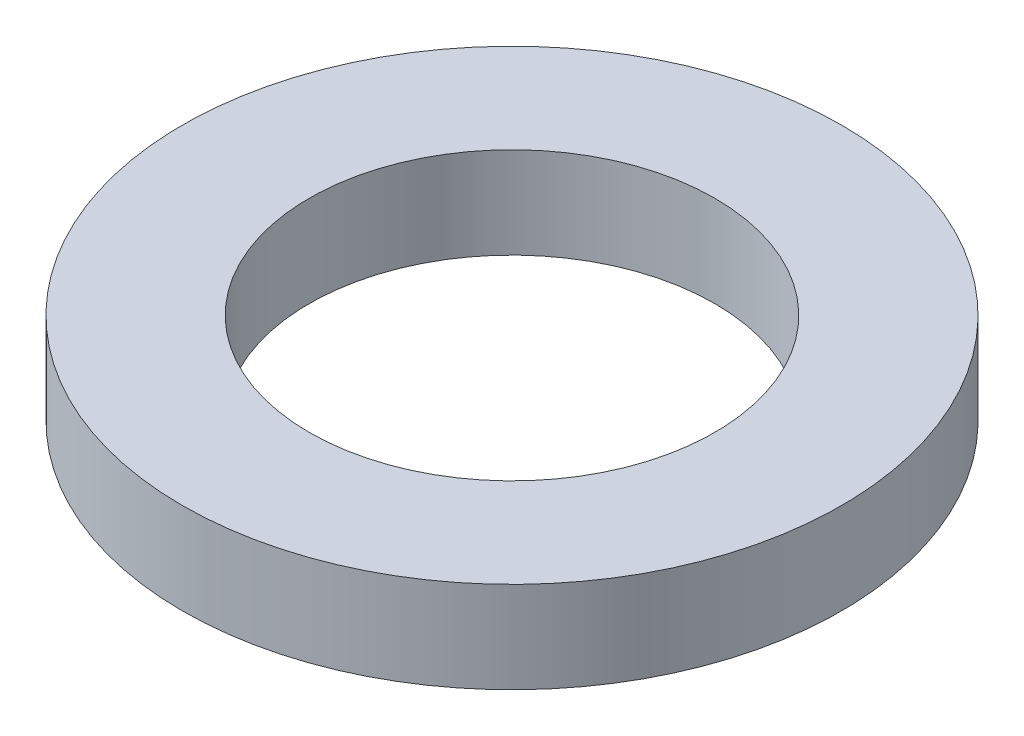
ISO-10303-21;
HEADER;
FILE_DESCRIPTION(('STEP AP214'),'2;1');
FILE_NAME('part.step','',(''),(''),'','','');
FILE_SCHEMA(('AUTOMOTIVE_DESIGN { 1 0 10303 214 1 1 1 1 }'));
ENDSEC;
DATA;
#1=APPLICATION_CONTEXT('core data for automotive mechanical design processes');
#2=APPLICATION_PROTOCOL_DEFINITION('international standard','automotive_design',2000,#1);
#3=PRODUCT_CONTEXT('',#1,'mechanical');
#4=PRODUCT('Part','Part','',(#3));
#5=PRODUCT_RELATED_PRODUCT_CATEGORY('part','',(#4));
#6=PRODUCT_DEFINITION_FORMATION('','',#4);
#7=PRODUCT_DEFINITION_CONTEXT('part definition',#1,'design');
#8=PRODUCT_DEFINITION('design','',#6,#7);
#9=PRODUCT_DEFINITION_SHAPE('','',#8);
#10=(LENGTH_UNIT() NAMED_UNIT(*) SI_UNIT(.MILLI.,.METRE.));
#11=(NAMED_UNIT(*) PLANE_ANGLE_UNIT() SI_UNIT($,.RADIAN.));
#12=(NAMED_UNIT(*) SI_UNIT($,.STERADIAN.) SOLID_ANGLE_UNIT());
#13=UNCERTAINTY_MEASURE_WITH_UNIT(LENGTH_MEASURE(1.E-05),#10,'distance_accuracy_value','');
#14=(GEOMETRIC_REPRESENTATION_CONTEXT(3) GLOBAL_UNCERTAINTY_ASSIGNED_CONTEXT((#13)) GLOBAL_UNIT_ASSIGNED_CONTEXT((#10,
#11,#12)) REPRESENTATION_CONTEXT('',''));
#15=CARTESIAN_POINT('',(0.,0.,0.));
#16=DIRECTION('',(0.,0.,1.));
#17=DIRECTION('',(1.,0.,0.));
#18=AXIS2_PLACEMENT_3D('',#15,#16,#17);
#19=CARTESIAN_POINT('',(0.,18.,0.));
#20=DIRECTION('',(0.,-1.,0.));
#21=DIRECTION('',(0.,0.,-1.));
#22=AXIS2_PLACEMENT_3D('',#19,#20,#21);
#23=CYLINDRICAL_SURFACE('',#22,65.);
#24=CARTESIAN_POINT('',(0.,18.,0.));
#25=DIRECTION('',(0.,1.,0.));
#26=DIRECTION('',(0.,0.,1.));
#27=AXIS2_PLACEMENT_3D('',#24,#25,#26);
#28=CIRCLE('',#27,65.);
#29=CARTESIAN_POINT('',(0.,18.,65.));
#30=VERTEX_POINT('',#29);
#31=EDGE_CURVE('E10',#30,#30,#28,.T.);
#32=ORIENTED_EDGE('',*,*,#31,.F.);
#33=EDGE_LOOP('',(#32));
#34=FACE_BOUND('',#33,.T.);
#35=CARTESIAN_POINT('',(0.,0.,0.));
#36=DIRECTION('',(0.,1.,0.));
#37=DIRECTION('',(0.,0.,1.));
#38=AXIS2_PLACEMENT_3D('',#35,#36,#37);
#39=CIRCLE('',#38,65.);
#40=CARTESIAN_POINT('',(0.,0.,65.));
#41=VERTEX_POINT('',#40);
#42=EDGE_CURVE('E37',#41,#41,#39,.T.);
#43=ORIENTED_EDGE('',*,*,#42,.T.);
#44=EDGE_LOOP('',(#43));
#45=FACE_BOUND('',#44,.T.);
#46=ADVANCED_FACE('F40',(#34,#45),#23,.T.);
#47=CARTESIAN_POINT('',(0.,18.,0.));
#48=DIRECTION('',(0.,1.,0.));
#49=DIRECTION('',(0.,0.,1.));
#50=AXIS2_PLACEMENT_3D('',#47,#48,#49);
#51=PLANE('',#50);
#52=CARTESIAN_POINT('',(0.,18.,0.));
#53=DIRECTION('',(0.,1.,0.));
#54=DIRECTION('',(0.,0.,1.));
#55=AXIS2_PLACEMENT_3D('',#52,#53,#54);
#56=CIRCLE('',#55,40.);
#57=CARTESIAN_POINT('',(0.,18.,40.));
#58=VERTEX_POINT('',#57);
#59=EDGE_CURVE('E50',#58,#58,#56,.T.);
#60=ORIENTED_EDGE('',*,*,#59,.F.);
#61=EDGE_LOOP('',(#60));
#62=FACE_BOUND('',#61,.T.);
#63=ORIENTED_EDGE('',*,*,#31,.T.);
#64=EDGE_LOOP('',(#63));
#65=FACE_BOUND('',#64,.T.);
#66=ADVANCED_FACE('F59',(#62,#65),#51,.T.);
#67=CARTESIAN_POINT('',(0.,0.,0.));
#68=DIRECTION('',(0.,1.,0.));
#69=DIRECTION('',(0.,0.,1.));
#70=AXIS2_PLACEMENT_3D('',#67,#68,#69);
#71=PLANE('',#70);
#72=CARTESIAN_POINT('',(0.,0.,0.));
#73=DIRECTION('',(0.,1.,0.));
#74=DIRECTION('',(0.,0.,1.));
#75=AXIS2_PLACEMENT_3D('',#72,#73,#74);
#76=CIRCLE('',#75,40.);
#77=CARTESIAN_POINT('',(0.,0.,40.));
#78=VERTEX_POINT('',#77);
#79=EDGE_CURVE('E47',#78,#78,#76,.T.);
#80=ORIENTED_EDGE('',*,*,#79,.T.);
#81=EDGE_LOOP('',(#80));
#82=FACE_BOUND('',#81,.T.);
#83=ORIENTED_EDGE('',*,*,#42,.F.);
#84=EDGE_LOOP('',(#83));
#85=FACE_BOUND('',#84,.T.);
#86=ADVANCED_FACE('F58',(#82,#85),#71,.F.);
#87=CARTESIAN_POINT('',(0.,18.,0.));
#88=DIRECTION('',(0.,-1.,0.));
#89=DIRECTION('',(0.,0.,-1.));
#90=AXIS2_PLACEMENT_3D('',#87,#88,#89);
#91=CYLINDRICAL_SURFACE('',#90,40.);
#92=ORIENTED_EDGE('',*,*,#59,.T.);
#93=EDGE_LOOP('',(#92));
#94=FACE_BOUND('',#93,.T.);
#95=ORIENTED_EDGE('',*,*,#79,.F.);
#96=EDGE_LOOP('',(#95));
#97=FACE_BOUND('',#96,.T.);
#98=ADVANCED_FACE('F54',(#94,#97),#91,.F.);
#99=CLOSED_SHELL('',(#46,#66,#86,#98));
#100=MANIFOLD_SOLID_BREP('B2',#99);
#101=ADVANCED_BREP_SHAPE_REPRESENTATION('',(#18,#100),#14);
#102=SHAPE_DEFINITION_REPRESENTATION(#9,#101);
ENDSEC;
END-ISO-10303-21;
